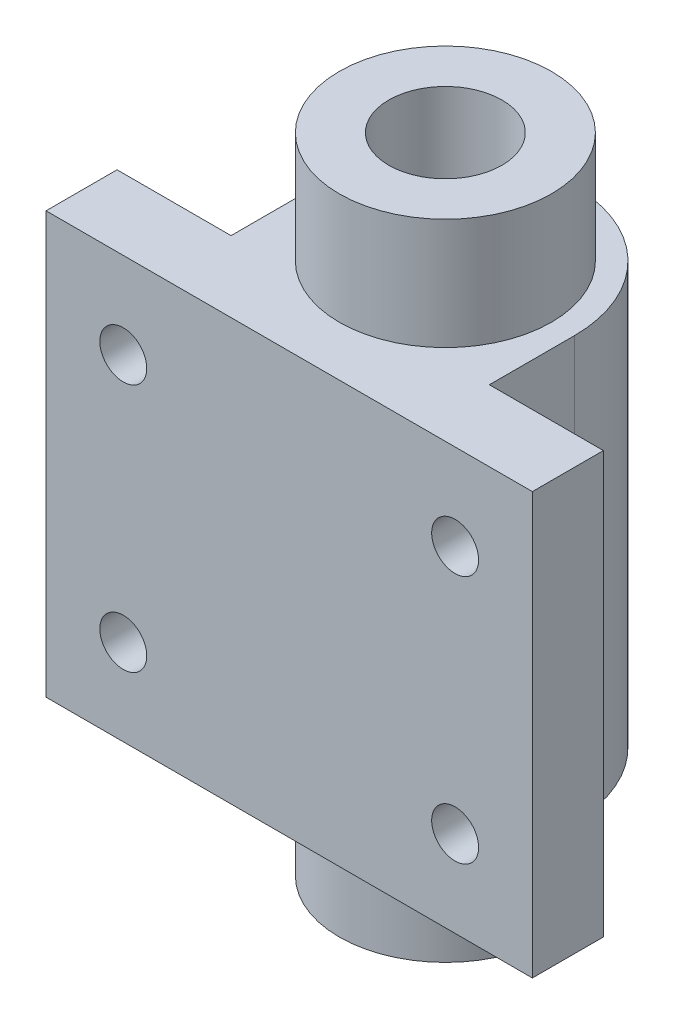
ISO-10303-21;
HEADER;
FILE_DESCRIPTION(('STEP AP214'),'2;1');
FILE_NAME('part.step','',(''),(''),'','','');
FILE_SCHEMA(('AUTOMOTIVE_DESIGN { 1 0 10303 214 1 1 1 1 }'));
ENDSEC;
DATA;
#1=APPLICATION_CONTEXT('core data for automotive mechanical design processes');
#2=APPLICATION_PROTOCOL_DEFINITION('international standard','automotive_design',2000,#1);
#3=PRODUCT_CONTEXT('',#1,'mechanical');
#4=PRODUCT('Part','Part','',(#3));
#5=PRODUCT_RELATED_PRODUCT_CATEGORY('part','',(#4));
#6=PRODUCT_DEFINITION_FORMATION('','',#4);
#7=PRODUCT_DEFINITION_CONTEXT('part definition',#1,'design');
#8=PRODUCT_DEFINITION('design','',#6,#7);
#9=PRODUCT_DEFINITION_SHAPE('','',#8);
#10=(LENGTH_UNIT() NAMED_UNIT(*) SI_UNIT(.MILLI.,.METRE.));
#11=(NAMED_UNIT(*) PLANE_ANGLE_UNIT() SI_UNIT($,.RADIAN.));
#12=(NAMED_UNIT(*) SI_UNIT($,.STERADIAN.) SOLID_ANGLE_UNIT());
#13=UNCERTAINTY_MEASURE_WITH_UNIT(LENGTH_MEASURE(1.E-05),#10,'distance_accuracy_value','');
#14=(GEOMETRIC_REPRESENTATION_CONTEXT(3) GLOBAL_UNCERTAINTY_ASSIGNED_CONTEXT((#13)) GLOBAL_UNIT_ASSIGNED_CONTEXT((#10,
#11,#12)) REPRESENTATION_CONTEXT('',''));
#15=CARTESIAN_POINT('',(0.,0.,0.));
#16=DIRECTION('',(0.,0.,1.));
#17=DIRECTION('',(1.,0.,0.));
#18=AXIS2_PLACEMENT_3D('',#15,#16,#17);
#19=CARTESIAN_POINT('',(0.,0.,-11.04));
#20=DIRECTION('',(0.,1.,0.));
#21=DIRECTION('',(0.,0.,1.));
#22=AXIS2_PLACEMENT_3D('',#19,#20,#21);
#23=PLANE('',#22);
#24=DIRECTION('',(1.,0.,0.));
#25=VECTOR('',#24,1.);
#26=CARTESIAN_POINT('',(0.,0.,0.));
#27=LINE('',#26,#25);
#28=CARTESIAN_POINT('',(-17.19,0.,0.));
#29=VERTEX_POINT('',#28);
#30=CARTESIAN_POINT('',(17.19,0.,0.));
#31=VERTEX_POINT('',#30);
#32=EDGE_CURVE('E87',#29,#31,#27,.T.);
#33=ORIENTED_EDGE('',*,*,#32,.F.);
#34=DIRECTION('',(0.,0.,1.));
#35=VECTOR('',#34,1.);
#36=CARTESIAN_POINT('',(-17.19,0.,0.));
#37=LINE('',#36,#35);
#38=CARTESIAN_POINT('',(-17.1900000000001,0.,-5.01999999999994));
#39=VERTEX_POINT('',#38);
#40=EDGE_CURVE('E144',#39,#29,#37,.T.);
#41=ORIENTED_EDGE('',*,*,#40,.F.);
#42=DIRECTION('',(-1.,0.,0.));
#43=VECTOR('',#42,1.);
#44=CARTESIAN_POINT('',(-17.1900000000001,0.,-5.01999999999994));
#45=LINE('',#44,#43);
#46=CARTESIAN_POINT('',(-9.13,0.,-5.01999999999999));
#47=VERTEX_POINT('',#46);
#48=EDGE_CURVE('E80',#47,#39,#45,.T.);
#49=ORIENTED_EDGE('',*,*,#48,.F.);
#50=DIRECTION('',(0.,0.,1.));
#51=VECTOR('',#50,1.);
#52=CARTESIAN_POINT('',(-9.13,0.,-5.01999999999999));
#53=LINE('',#52,#51);
#54=CARTESIAN_POINT('',(-9.13,0.,-11.04));
#55=VERTEX_POINT('',#54);
#56=EDGE_CURVE('E122',#55,#47,#53,.T.);
#57=ORIENTED_EDGE('',*,*,#56,.F.);
#58=CARTESIAN_POINT('',(0.,0.,-11.04));
#59=DIRECTION('',(0.,1.,0.));
#60=DIRECTION('',(0.,0.,1.));
#61=AXIS2_PLACEMENT_3D('',#58,#59,#60);
#62=CIRCLE('',#61,9.13);
#63=CARTESIAN_POINT('',(9.13,0.,-11.04));
#64=VERTEX_POINT('',#63);
#65=EDGE_CURVE('E140',#64,#55,#62,.T.);
#66=ORIENTED_EDGE('',*,*,#65,.F.);
#67=DIRECTION('',(0.,0.,-1.));
#68=VECTOR('',#67,1.);
#69=CARTESIAN_POINT('',(9.12999999999997,0.,-5.02));
#70=LINE('',#69,#68);
#71=CARTESIAN_POINT('',(9.12999999999997,0.,-5.02));
#72=VERTEX_POINT('',#71);
#73=EDGE_CURVE('E138',#72,#64,#70,.T.);
#74=ORIENTED_EDGE('',*,*,#73,.F.);
#75=DIRECTION('',(-1.,0.,0.));
#76=VECTOR('',#75,1.);
#77=CARTESIAN_POINT('',(17.19,0.,-5.02));
#78=LINE('',#77,#76);
#79=CARTESIAN_POINT('',(17.19,0.,-5.02));
#80=VERTEX_POINT('',#79);
#81=EDGE_CURVE('E136',#80,#72,#78,.T.);
#82=ORIENTED_EDGE('',*,*,#81,.F.);
#83=DIRECTION('',(0.,0.,-1.));
#84=VECTOR('',#83,1.);
#85=CARTESIAN_POINT('',(17.19,0.,0.));
#86=LINE('',#85,#84);
#87=EDGE_CURVE('E133',#31,#80,#86,.T.);
#88=ORIENTED_EDGE('',*,*,#87,.F.);
#89=EDGE_LOOP('',(#33,#41,#49,#57,#66,#74,#82,#88));
#90=FACE_BOUND('',#89,.T.);
#91=CARTESIAN_POINT('',(0.,0.,-11.04));
#92=DIRECTION('',(0.,1.,0.));
#93=DIRECTION('',(0.,0.,1.));
#94=AXIS2_PLACEMENT_3D('',#91,#92,#93);
#95=CIRCLE('',#94,7.5);
#96=CARTESIAN_POINT('',(0.,0.,-3.53999999999999));
#97=VERTEX_POINT('',#96);
#98=EDGE_CURVE('E11',#97,#97,#95,.F.);
#99=ORIENTED_EDGE('',*,*,#98,.F.);
#100=EDGE_LOOP('',(#99));
#101=FACE_BOUND('',#100,.T.);
#102=ADVANCED_FACE('F32',(#90,#101),#23,.F.);
#103=CARTESIAN_POINT('',(0.,29.78,-11.04));
#104=DIRECTION('',(0.,1.,0.));
#105=DIRECTION('',(0.,0.,1.));
#106=AXIS2_PLACEMENT_3D('',#103,#104,#105);
#107=PLANE('',#106);
#108=DIRECTION('',(1.,0.,0.));
#109=VECTOR('',#108,1.);
#110=CARTESIAN_POINT('',(0.,29.78,0.));
#111=LINE('',#110,#109);
#112=CARTESIAN_POINT('',(-17.19,29.78,0.));
#113=VERTEX_POINT('',#112);
#114=CARTESIAN_POINT('',(17.19,29.78,0.));
#115=VERTEX_POINT('',#114);
#116=EDGE_CURVE('E93',#113,#115,#111,.T.);
#117=ORIENTED_EDGE('',*,*,#116,.T.);
#118=DIRECTION('',(0.,0.,-1.));
#119=VECTOR('',#118,1.);
#120=CARTESIAN_POINT('',(17.19,29.78,0.));
#121=LINE('',#120,#119);
#122=CARTESIAN_POINT('',(17.19,29.78,-5.02));
#123=VERTEX_POINT('',#122);
#124=EDGE_CURVE('E194',#115,#123,#121,.T.);
#125=ORIENTED_EDGE('',*,*,#124,.T.);
#126=DIRECTION('',(-1.,0.,0.));
#127=VECTOR('',#126,1.);
#128=CARTESIAN_POINT('',(17.19,29.78,-5.02));
#129=LINE('',#128,#127);
#130=CARTESIAN_POINT('',(9.12999999999997,29.78,-5.02));
#131=VERTEX_POINT('',#130);
#132=EDGE_CURVE('E196',#123,#131,#129,.T.);
#133=ORIENTED_EDGE('',*,*,#132,.T.);
#134=DIRECTION('',(0.,0.,-1.));
#135=VECTOR('',#134,1.);
#136=CARTESIAN_POINT('',(9.12999999999997,29.78,-5.02));
#137=LINE('',#136,#135);
#138=CARTESIAN_POINT('',(9.13,29.78,-11.04));
#139=VERTEX_POINT('',#138);
#140=EDGE_CURVE('E198',#131,#139,#137,.T.);
#141=ORIENTED_EDGE('',*,*,#140,.T.);
#142=CARTESIAN_POINT('',(0.,29.78,-11.04));
#143=DIRECTION('',(0.,1.,0.));
#144=DIRECTION('',(0.,0.,1.));
#145=AXIS2_PLACEMENT_3D('',#142,#143,#144);
#146=CIRCLE('',#145,9.13);
#147=CARTESIAN_POINT('',(-9.13,29.78,-11.04));
#148=VERTEX_POINT('',#147);
#149=EDGE_CURVE('E114',#139,#148,#146,.T.);
#150=ORIENTED_EDGE('',*,*,#149,.T.);
#151=DIRECTION('',(0.,0.,1.));
#152=VECTOR('',#151,1.);
#153=CARTESIAN_POINT('',(-9.13,29.78,-5.01999999999999));
#154=LINE('',#153,#152);
#155=CARTESIAN_POINT('',(-9.13,29.78,-5.01999999999999));
#156=VERTEX_POINT('',#155);
#157=EDGE_CURVE('E107',#148,#156,#154,.T.);
#158=ORIENTED_EDGE('',*,*,#157,.T.);
#159=DIRECTION('',(-1.,0.,0.));
#160=VECTOR('',#159,1.);
#161=CARTESIAN_POINT('',(-17.1900000000001,29.78,-5.01999999999994));
#162=LINE('',#161,#160);
#163=CARTESIAN_POINT('',(-17.1900000000001,29.78,-5.01999999999994));
#164=VERTEX_POINT('',#163);
#165=EDGE_CURVE('E112',#156,#164,#162,.T.);
#166=ORIENTED_EDGE('',*,*,#165,.T.);
#167=DIRECTION('',(0.,0.,1.));
#168=VECTOR('',#167,1.);
#169=CARTESIAN_POINT('',(-17.19,29.78,0.));
#170=LINE('',#169,#168);
#171=EDGE_CURVE('E51',#164,#113,#170,.T.);
#172=ORIENTED_EDGE('',*,*,#171,.T.);
#173=EDGE_LOOP('',(#117,#125,#133,#141,#150,#158,#166,#172));
#174=FACE_BOUND('',#173,.T.);
#175=CARTESIAN_POINT('',(0.,29.78,-11.04));
#176=DIRECTION('',(0.,1.,0.));
#177=DIRECTION('',(0.,0.,1.));
#178=AXIS2_PLACEMENT_3D('',#175,#176,#177);
#179=CIRCLE('',#178,7.5);
#180=CARTESIAN_POINT('',(0.,29.78,-3.53999999999999));
#181=VERTEX_POINT('',#180);
#182=EDGE_CURVE('E188',#181,#181,#179,.T.);
#183=ORIENTED_EDGE('',*,*,#182,.F.);
#184=EDGE_LOOP('',(#183));
#185=FACE_BOUND('',#184,.T.);
#186=ADVANCED_FACE('F109',(#174,#185),#107,.T.);
#187=CARTESIAN_POINT('',(0.,29.78,0.));
#188=DIRECTION('',(0.,0.,-1.));
#189=DIRECTION('',(-1.,0.,0.));
#190=AXIS2_PLACEMENT_3D('',#187,#188,#189);
#191=PLANE('',#190);
#192=CARTESIAN_POINT('',(-11.73,6.09,0.));
#193=DIRECTION('',(0.,0.,1.));
#194=DIRECTION('',(-1.,0.,0.));
#195=AXIS2_PLACEMENT_3D('',#192,#193,#194);
#196=CIRCLE('',#195,1.66);
#197=CARTESIAN_POINT('',(-13.39,6.09,0.));
#198=VERTEX_POINT('',#197);
#199=EDGE_CURVE('E402',#198,#198,#196,.T.);
#200=ORIENTED_EDGE('',*,*,#199,.F.);
#201=EDGE_LOOP('',(#200));
#202=FACE_BOUND('',#201,.T.);
#203=CARTESIAN_POINT('',(11.73,6.09,0.));
#204=DIRECTION('',(0.,0.,1.));
#205=DIRECTION('',(1.,0.,0.));
#206=AXIS2_PLACEMENT_3D('',#203,#204,#205);
#207=CIRCLE('',#206,1.66);
#208=CARTESIAN_POINT('',(13.39,6.09,0.));
#209=VERTEX_POINT('',#208);
#210=EDGE_CURVE('E406',#209,#209,#207,.T.);
#211=ORIENTED_EDGE('',*,*,#210,.F.);
#212=EDGE_LOOP('',(#211));
#213=FACE_BOUND('',#212,.T.);
#214=CARTESIAN_POINT('',(11.73,23.69,0.));
#215=DIRECTION('',(0.,0.,1.));
#216=DIRECTION('',(-1.,0.,0.));
#217=AXIS2_PLACEMENT_3D('',#214,#215,#216);
#218=CIRCLE('',#217,1.66);
#219=CARTESIAN_POINT('',(10.07,23.69,0.));
#220=VERTEX_POINT('',#219);
#221=EDGE_CURVE('E410',#220,#220,#218,.T.);
#222=ORIENTED_EDGE('',*,*,#221,.F.);
#223=EDGE_LOOP('',(#222));
#224=FACE_BOUND('',#223,.T.);
#225=CARTESIAN_POINT('',(-11.73,23.69,0.));
#226=DIRECTION('',(0.,0.,1.));
#227=DIRECTION('',(1.,0.,0.));
#228=AXIS2_PLACEMENT_3D('',#225,#226,#227);
#229=CIRCLE('',#228,1.66);
#230=CARTESIAN_POINT('',(-10.07,23.69,0.));
#231=VERTEX_POINT('',#230);
#232=EDGE_CURVE('E165',#231,#231,#229,.T.);
#233=ORIENTED_EDGE('',*,*,#232,.F.);
#234=EDGE_LOOP('',(#233));
#235=FACE_BOUND('',#234,.T.);
#236=ORIENTED_EDGE('',*,*,#32,.T.);
#237=DIRECTION('',(0.,-1.,0.));
#238=VECTOR('',#237,1.);
#239=CARTESIAN_POINT('',(17.19,29.78,0.));
#240=LINE('',#239,#238);
#241=EDGE_CURVE('E42',#115,#31,#240,.T.);
#242=ORIENTED_EDGE('',*,*,#241,.F.);
#243=ORIENTED_EDGE('',*,*,#116,.F.);
#244=DIRECTION('',(0.,-1.,0.));
#245=VECTOR('',#244,1.);
#246=CARTESIAN_POINT('',(-17.19,29.78,0.));
#247=LINE('',#246,#245);
#248=EDGE_CURVE('E128',#113,#29,#247,.T.);
#249=ORIENTED_EDGE('',*,*,#248,.T.);
#250=EDGE_LOOP('',(#236,#242,#243,#249));
#251=FACE_BOUND('',#250,.T.);
#252=ADVANCED_FACE('F34',(#202,#213,#224,#235,#251),#191,.F.);
#253=CARTESIAN_POINT('',(17.19,29.78,0.));
#254=DIRECTION('',(-1.,0.,0.));
#255=DIRECTION('',(0.,0.,1.));
#256=AXIS2_PLACEMENT_3D('',#253,#254,#255);
#257=PLANE('',#256);
#258=ORIENTED_EDGE('',*,*,#87,.T.);
#259=DIRECTION('',(0.,-1.,0.));
#260=VECTOR('',#259,1.);
#261=CARTESIAN_POINT('',(17.19,29.78,-5.02));
#262=LINE('',#261,#260);
#263=EDGE_CURVE('E156',#123,#80,#262,.T.);
#264=ORIENTED_EDGE('',*,*,#263,.F.);
#265=ORIENTED_EDGE('',*,*,#124,.F.);
#266=ORIENTED_EDGE('',*,*,#241,.T.);
#267=EDGE_LOOP('',(#258,#264,#265,#266));
#268=FACE_BOUND('',#267,.T.);
#269=ADVANCED_FACE('F216',(#268),#257,.F.);
#270=CARTESIAN_POINT('',(17.19,29.78,-5.02));
#271=DIRECTION('',(0.,0.,1.));
#272=DIRECTION('',(1.,0.,0.));
#273=AXIS2_PLACEMENT_3D('',#270,#271,#272);
#274=PLANE('',#273);
#275=CARTESIAN_POINT('',(11.73,6.09,-5.02));
#276=DIRECTION('',(0.,0.,1.));
#277=DIRECTION('',(1.,0.,0.));
#278=AXIS2_PLACEMENT_3D('',#275,#276,#277);
#279=CIRCLE('',#278,1.66);
#280=CARTESIAN_POINT('',(13.39,6.09,-5.02));
#281=VERTEX_POINT('',#280);
#282=EDGE_CURVE('E36',#281,#281,#279,.T.);
#283=ORIENTED_EDGE('',*,*,#282,.T.);
#284=EDGE_LOOP('',(#283));
#285=FACE_BOUND('',#284,.T.);
#286=CARTESIAN_POINT('',(11.73,23.69,-5.02));
#287=DIRECTION('',(0.,0.,1.));
#288=DIRECTION('',(1.,0.,0.));
#289=AXIS2_PLACEMENT_3D('',#286,#287,#288);
#290=CIRCLE('',#289,1.66);
#291=CARTESIAN_POINT('',(13.39,23.69,-5.02));
#292=VERTEX_POINT('',#291);
#293=EDGE_CURVE('E167',#292,#292,#290,.T.);
#294=ORIENTED_EDGE('',*,*,#293,.T.);
#295=EDGE_LOOP('',(#294));
#296=FACE_BOUND('',#295,.T.);
#297=ORIENTED_EDGE('',*,*,#81,.T.);
#298=DIRECTION('',(0.,-1.,0.));
#299=VECTOR('',#298,1.);
#300=CARTESIAN_POINT('',(9.12999999999997,29.78,-5.02));
#301=LINE('',#300,#299);
#302=EDGE_CURVE('E153',#131,#72,#301,.T.);
#303=ORIENTED_EDGE('',*,*,#302,.F.);
#304=ORIENTED_EDGE('',*,*,#132,.F.);
#305=ORIENTED_EDGE('',*,*,#263,.T.);
#306=EDGE_LOOP('',(#297,#303,#304,#305));
#307=FACE_BOUND('',#306,.T.);
#308=ADVANCED_FACE('F219',(#285,#296,#307),#274,.F.);
#309=CARTESIAN_POINT('',(9.12999999999997,29.78,-5.02));
#310=DIRECTION('',(-1.,0.,0.));
#311=DIRECTION('',(0.,0.,1.));
#312=AXIS2_PLACEMENT_3D('',#309,#310,#311);
#313=PLANE('',#312);
#314=ORIENTED_EDGE('',*,*,#73,.T.);
#315=DIRECTION('',(0.,-1.,0.));
#316=VECTOR('',#315,1.);
#317=CARTESIAN_POINT('',(9.13,29.78,-11.04));
#318=LINE('',#317,#316);
#319=EDGE_CURVE('E150',#139,#64,#318,.T.);
#320=ORIENTED_EDGE('',*,*,#319,.F.);
#321=ORIENTED_EDGE('',*,*,#140,.F.);
#322=ORIENTED_EDGE('',*,*,#302,.T.);
#323=EDGE_LOOP('',(#314,#320,#321,#322));
#324=FACE_BOUND('',#323,.T.);
#325=ADVANCED_FACE('F204',(#324),#313,.F.);
#326=CARTESIAN_POINT('',(0.,29.78,-11.04));
#327=DIRECTION('',(0.,-1.,0.));
#328=DIRECTION('',(0.,0.,-1.));
#329=AXIS2_PLACEMENT_3D('',#326,#327,#328);
#330=CYLINDRICAL_SURFACE('',#329,9.13);
#331=ORIENTED_EDGE('',*,*,#65,.T.);
#332=DIRECTION('',(0.,-1.,0.));
#333=VECTOR('',#332,1.);
#334=CARTESIAN_POINT('',(-9.13,29.78,-11.04));
#335=LINE('',#334,#333);
#336=EDGE_CURVE('E123',#148,#55,#335,.T.);
#337=ORIENTED_EDGE('',*,*,#336,.F.);
#338=ORIENTED_EDGE('',*,*,#149,.F.);
#339=ORIENTED_EDGE('',*,*,#319,.T.);
#340=EDGE_LOOP('',(#331,#337,#338,#339));
#341=FACE_BOUND('',#340,.T.);
#342=ADVANCED_FACE('F208',(#341),#330,.T.);
#343=CARTESIAN_POINT('',(-9.13,29.78,-5.01999999999999));
#344=DIRECTION('',(1.,0.,0.));
#345=DIRECTION('',(0.,0.,-1.));
#346=AXIS2_PLACEMENT_3D('',#343,#344,#345);
#347=PLANE('',#346);
#348=ORIENTED_EDGE('',*,*,#56,.T.);
#349=DIRECTION('',(0.,-1.,0.));
#350=VECTOR('',#349,1.);
#351=CARTESIAN_POINT('',(-9.13,29.78,-5.01999999999999));
#352=LINE('',#351,#350);
#353=EDGE_CURVE('E119',#156,#47,#352,.T.);
#354=ORIENTED_EDGE('',*,*,#353,.F.);
#355=ORIENTED_EDGE('',*,*,#157,.F.);
#356=ORIENTED_EDGE('',*,*,#336,.T.);
#357=EDGE_LOOP('',(#348,#354,#355,#356));
#358=FACE_BOUND('',#357,.T.);
#359=ADVANCED_FACE('F120',(#358),#347,.F.);
#360=CARTESIAN_POINT('',(-17.1900000000001,29.78,-5.01999999999994));
#361=DIRECTION('',(0.,0.,1.));
#362=DIRECTION('',(1.,0.,0.));
#363=AXIS2_PLACEMENT_3D('',#360,#361,#362);
#364=PLANE('',#363);
#365=CARTESIAN_POINT('',(-11.73,6.09,-5.01999999999998));
#366=DIRECTION('',(0.,0.,1.));
#367=DIRECTION('',(1.,0.,0.));
#368=AXIS2_PLACEMENT_3D('',#365,#366,#367);
#369=CIRCLE('',#368,1.66);
#370=CARTESIAN_POINT('',(-10.07,6.09,-5.01999999999999));
#371=VERTEX_POINT('',#370);
#372=EDGE_CURVE('E164',#371,#371,#369,.T.);
#373=ORIENTED_EDGE('',*,*,#372,.T.);
#374=EDGE_LOOP('',(#373));
#375=FACE_BOUND('',#374,.T.);
#376=CARTESIAN_POINT('',(-11.73,23.69,-5.01999999999998));
#377=DIRECTION('',(0.,0.,1.));
#378=DIRECTION('',(1.,0.,0.));
#379=AXIS2_PLACEMENT_3D('',#376,#377,#378);
#380=CIRCLE('',#379,1.66);
#381=CARTESIAN_POINT('',(-10.07,23.69,-5.01999999999999));
#382=VERTEX_POINT('',#381);
#383=EDGE_CURVE('E161',#382,#382,#380,.T.);
#384=ORIENTED_EDGE('',*,*,#383,.T.);
#385=EDGE_LOOP('',(#384));
#386=FACE_BOUND('',#385,.T.);
#387=ORIENTED_EDGE('',*,*,#48,.T.);
#388=DIRECTION('',(0.,-1.,0.));
#389=VECTOR('',#388,1.);
#390=CARTESIAN_POINT('',(-17.1900000000001,29.78,-5.01999999999994));
#391=LINE('',#390,#389);
#392=EDGE_CURVE('E124',#164,#39,#391,.T.);
#393=ORIENTED_EDGE('',*,*,#392,.F.);
#394=ORIENTED_EDGE('',*,*,#165,.F.);
#395=ORIENTED_EDGE('',*,*,#353,.T.);
#396=EDGE_LOOP('',(#387,#393,#394,#395));
#397=FACE_BOUND('',#396,.T.);
#398=ADVANCED_FACE('F126',(#375,#386,#397),#364,.F.);
#399=CARTESIAN_POINT('',(-17.19,29.78,0.));
#400=DIRECTION('',(1.,0.,0.));
#401=DIRECTION('',(0.,0.,-1.));
#402=AXIS2_PLACEMENT_3D('',#399,#400,#401);
#403=PLANE('',#402);
#404=ORIENTED_EDGE('',*,*,#40,.T.);
#405=ORIENTED_EDGE('',*,*,#248,.F.);
#406=ORIENTED_EDGE('',*,*,#171,.F.);
#407=ORIENTED_EDGE('',*,*,#392,.T.);
#408=EDGE_LOOP('',(#404,#405,#406,#407));
#409=FACE_BOUND('',#408,.T.);
#410=ADVANCED_FACE('F211',(#409),#403,.F.);
#411=CARTESIAN_POINT('',(0.,29.78,-11.04));
#412=DIRECTION('',(0.,-1.,0.));
#413=DIRECTION('',(0.,0.,-1.));
#414=AXIS2_PLACEMENT_3D('',#411,#412,#413);
#415=CYLINDRICAL_SURFACE('',#414,4.);
#416=CARTESIAN_POINT('',(0.,37.64,-11.04));
#417=DIRECTION('',(0.,1.,0.));
#418=DIRECTION('',(0.,0.,1.));
#419=AXIS2_PLACEMENT_3D('',#416,#417,#418);
#420=CIRCLE('',#419,4.);
#421=CARTESIAN_POINT('',(0.,37.64,-7.03999999999999));
#422=VERTEX_POINT('',#421);
#423=EDGE_CURVE('E181',#422,#422,#420,.T.);
#424=ORIENTED_EDGE('',*,*,#423,.T.);
#425=EDGE_LOOP('',(#424));
#426=FACE_BOUND('',#425,.T.);
#427=CARTESIAN_POINT('',(0.,-7.86,-11.04));
#428=DIRECTION('',(0.,-1.,0.));
#429=DIRECTION('',(0.,0.,-1.));
#430=AXIS2_PLACEMENT_3D('',#427,#428,#429);
#431=CIRCLE('',#430,4.);
#432=CARTESIAN_POINT('',(0.,-7.86,-15.04));
#433=VERTEX_POINT('',#432);
#434=EDGE_CURVE('E172',#433,#433,#431,.T.);
#435=ORIENTED_EDGE('',*,*,#434,.T.);
#436=EDGE_LOOP('',(#435));
#437=FACE_BOUND('',#436,.T.);
#438=ADVANCED_FACE('F237',(#426,#437),#415,.F.);
#439=CARTESIAN_POINT('',(0.,37.64,-11.04));
#440=DIRECTION('',(0.,1.,0.));
#441=DIRECTION('',(0.,0.,1.));
#442=AXIS2_PLACEMENT_3D('',#439,#440,#441);
#443=PLANE('',#442);
#444=CARTESIAN_POINT('',(0.,37.64,-11.04));
#445=DIRECTION('',(0.,1.,0.));
#446=DIRECTION('',(0.,0.,1.));
#447=AXIS2_PLACEMENT_3D('',#444,#445,#446);
#448=CIRCLE('',#447,7.5);
#449=CARTESIAN_POINT('',(0.,37.64,-3.53999999999999));
#450=VERTEX_POINT('',#449);
#451=EDGE_CURVE('E134',#450,#450,#448,.T.);
#452=ORIENTED_EDGE('',*,*,#451,.T.);
#453=EDGE_LOOP('',(#452));
#454=FACE_BOUND('',#453,.T.);
#455=ORIENTED_EDGE('',*,*,#423,.F.);
#456=EDGE_LOOP('',(#455));
#457=FACE_BOUND('',#456,.T.);
#458=ADVANCED_FACE('F268',(#454,#457),#443,.T.);
#459=CARTESIAN_POINT('',(0.,37.64,-11.04));
#460=DIRECTION('',(0.,-1.,0.));
#461=DIRECTION('',(0.,0.,-1.));
#462=AXIS2_PLACEMENT_3D('',#459,#460,#461);
#463=CYLINDRICAL_SURFACE('',#462,7.5);
#464=ORIENTED_EDGE('',*,*,#451,.F.);
#465=EDGE_LOOP('',(#464));
#466=FACE_BOUND('',#465,.T.);
#467=ORIENTED_EDGE('',*,*,#182,.T.);
#468=EDGE_LOOP('',(#467));
#469=FACE_BOUND('',#468,.T.);
#470=ADVANCED_FACE('F276',(#466,#469),#463,.T.);
#471=CARTESIAN_POINT('',(0.,-7.86,-11.04));
#472=DIRECTION('',(0.,-1.,0.));
#473=DIRECTION('',(0.,0.,-1.));
#474=AXIS2_PLACEMENT_3D('',#471,#472,#473);
#475=PLANE('',#474);
#476=CARTESIAN_POINT('',(0.,-7.86,-11.04));
#477=DIRECTION('',(0.,-1.,0.));
#478=DIRECTION('',(0.,0.,-1.));
#479=AXIS2_PLACEMENT_3D('',#476,#477,#478);
#480=CIRCLE('',#479,7.5);
#481=CARTESIAN_POINT('',(0.,-7.86,-18.54));
#482=VERTEX_POINT('',#481);
#483=EDGE_CURVE('E176',#482,#482,#480,.T.);
#484=ORIENTED_EDGE('',*,*,#483,.T.);
#485=EDGE_LOOP('',(#484));
#486=FACE_BOUND('',#485,.T.);
#487=ORIENTED_EDGE('',*,*,#434,.F.);
#488=EDGE_LOOP('',(#487));
#489=FACE_BOUND('',#488,.T.);
#490=ADVANCED_FACE('F284',(#486,#489),#475,.T.);
#491=CARTESIAN_POINT('',(0.,-7.86,-11.04));
#492=DIRECTION('',(0.,1.,0.));
#493=DIRECTION('',(0.,0.,1.));
#494=AXIS2_PLACEMENT_3D('',#491,#492,#493);
#495=CYLINDRICAL_SURFACE('',#494,7.5);
#496=ORIENTED_EDGE('',*,*,#483,.F.);
#497=EDGE_LOOP('',(#496));
#498=FACE_BOUND('',#497,.T.);
#499=ORIENTED_EDGE('',*,*,#98,.T.);
#500=EDGE_LOOP('',(#499));
#501=FACE_BOUND('',#500,.T.);
#502=ADVANCED_FACE('F291',(#498,#501),#495,.T.);
#503=CARTESIAN_POINT('',(-11.73,23.69,-20.17));
#504=DIRECTION('',(0.,0.,1.));
#505=DIRECTION('',(1.,0.,0.));
#506=AXIS2_PLACEMENT_3D('',#503,#504,#505);
#507=CYLINDRICAL_SURFACE('',#506,1.66);
#508=ORIENTED_EDGE('',*,*,#232,.T.);
#509=EDGE_LOOP('',(#508));
#510=FACE_BOUND('',#509,.T.);
#511=ORIENTED_EDGE('',*,*,#383,.F.);
#512=EDGE_LOOP('',(#511));
#513=FACE_BOUND('',#512,.T.);
#514=ADVANCED_FACE('F299',(#510,#513),#507,.F.);
#515=CARTESIAN_POINT('',(-11.73,6.09,-20.17));
#516=DIRECTION('',(0.,0.,1.));
#517=DIRECTION('',(1.,0.,0.));
#518=AXIS2_PLACEMENT_3D('',#515,#516,#517);
#519=CYLINDRICAL_SURFACE('',#518,1.66);
#520=ORIENTED_EDGE('',*,*,#199,.T.);
#521=EDGE_LOOP('',(#520));
#522=FACE_BOUND('',#521,.T.);
#523=ORIENTED_EDGE('',*,*,#372,.F.);
#524=EDGE_LOOP('',(#523));
#525=FACE_BOUND('',#524,.T.);
#526=ADVANCED_FACE('F307',(#522,#525),#519,.F.);
#527=CARTESIAN_POINT('',(11.73,23.69,-20.17));
#528=DIRECTION('',(0.,0.,1.));
#529=DIRECTION('',(1.,0.,0.));
#530=AXIS2_PLACEMENT_3D('',#527,#528,#529);
#531=CYLINDRICAL_SURFACE('',#530,1.66);
#532=ORIENTED_EDGE('',*,*,#221,.T.);
#533=EDGE_LOOP('',(#532));
#534=FACE_BOUND('',#533,.T.);
#535=ORIENTED_EDGE('',*,*,#293,.F.);
#536=EDGE_LOOP('',(#535));
#537=FACE_BOUND('',#536,.T.);
#538=ADVANCED_FACE('F315',(#534,#537),#531,.F.);
#539=CARTESIAN_POINT('',(11.73,6.09,-20.17));
#540=DIRECTION('',(0.,0.,1.));
#541=DIRECTION('',(1.,0.,0.));
#542=AXIS2_PLACEMENT_3D('',#539,#540,#541);
#543=CYLINDRICAL_SURFACE('',#542,1.66);
#544=ORIENTED_EDGE('',*,*,#210,.T.);
#545=EDGE_LOOP('',(#544));
#546=FACE_BOUND('',#545,.T.);
#547=ORIENTED_EDGE('',*,*,#282,.F.);
#548=EDGE_LOOP('',(#547));
#549=FACE_BOUND('',#548,.T.);
#550=ADVANCED_FACE('F323',(#546,#549),#543,.F.);
#551=CLOSED_SHELL('',(#102,#186,#252,#269,#308,#325,#342,#359,#398,#410,#438,#458,#470,#490,
#502,#514,#526,#538,#550));
#552=MANIFOLD_SOLID_BREP('B2',#551);
#553=ADVANCED_BREP_SHAPE_REPRESENTATION('',(#18,#552),#14);
#554=SHAPE_DEFINITION_REPRESENTATION(#9,#553);
ENDSEC;
END-ISO-10303-21;
